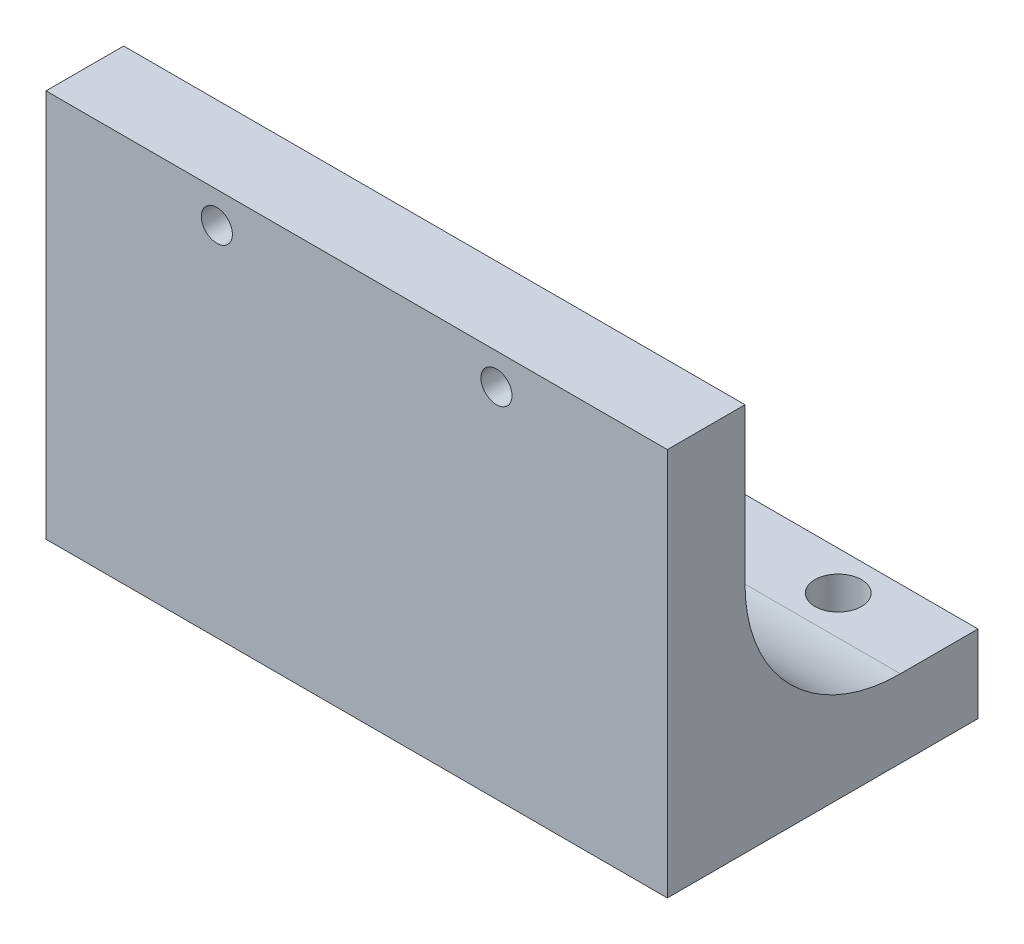
ISO-10303-21;
HEADER;
FILE_DESCRIPTION(('STEP AP214'),'2;1');
FILE_NAME('part.step','',(''),(''),'','','');
FILE_SCHEMA(('AUTOMOTIVE_DESIGN { 1 0 10303 214 1 1 1 1 }'));
ENDSEC;
DATA;
#1=APPLICATION_CONTEXT('core data for automotive mechanical design processes');
#2=APPLICATION_PROTOCOL_DEFINITION('international standard','automotive_design',2000,#1);
#3=PRODUCT_CONTEXT('',#1,'mechanical');
#4=PRODUCT('Part','Part','',(#3));
#5=PRODUCT_RELATED_PRODUCT_CATEGORY('part','',(#4));
#6=PRODUCT_DEFINITION_FORMATION('','',#4);
#7=PRODUCT_DEFINITION_CONTEXT('part definition',#1,'design');
#8=PRODUCT_DEFINITION('design','',#6,#7);
#9=PRODUCT_DEFINITION_SHAPE('','',#8);
#10=(LENGTH_UNIT() NAMED_UNIT(*) SI_UNIT(.MILLI.,.METRE.));
#11=(NAMED_UNIT(*) PLANE_ANGLE_UNIT() SI_UNIT($,.RADIAN.));
#12=(NAMED_UNIT(*) SI_UNIT($,.STERADIAN.) SOLID_ANGLE_UNIT());
#13=UNCERTAINTY_MEASURE_WITH_UNIT(LENGTH_MEASURE(1.E-05),#10,'distance_accuracy_value','');
#14=(GEOMETRIC_REPRESENTATION_CONTEXT(3) GLOBAL_UNCERTAINTY_ASSIGNED_CONTEXT((#13)) GLOBAL_UNIT_ASSIGNED_CONTEXT((#10,
#11,#12)) REPRESENTATION_CONTEXT('',''));
#15=CARTESIAN_POINT('',(0.,0.,0.));
#16=DIRECTION('',(0.,0.,1.));
#17=DIRECTION('',(1.,0.,0.));
#18=AXIS2_PLACEMENT_3D('',#15,#16,#17);
#19=CARTESIAN_POINT('',(0.,0.,0.));
#20=DIRECTION('',(0.,0.,-1.));
#21=DIRECTION('',(-1.,0.,0.));
#22=AXIS2_PLACEMENT_3D('',#19,#20,#21);
#23=PLANE('',#22);
#24=CARTESIAN_POINT('',(11.,23.,0.));
#25=DIRECTION('',(0.,0.,1.));
#26=DIRECTION('',(1.,0.,0.));
#27=AXIS2_PLACEMENT_3D('',#24,#25,#26);
#28=CIRCLE('',#27,1.);
#29=CARTESIAN_POINT('',(12.,23.,0.));
#30=VERTEX_POINT('',#29);
#31=EDGE_CURVE('E137',#30,#30,#28,.T.);
#32=ORIENTED_EDGE('',*,*,#31,.T.);
#33=EDGE_LOOP('',(#32));
#34=FACE_BOUND('',#33,.T.);
#35=CARTESIAN_POINT('',(29.,23.,0.));
#36=DIRECTION('',(0.,0.,1.));
#37=DIRECTION('',(1.,0.,0.));
#38=AXIS2_PLACEMENT_3D('',#35,#36,#37);
#39=CIRCLE('',#38,1.);
#40=CARTESIAN_POINT('',(30.,23.,0.));
#41=VERTEX_POINT('',#40);
#42=EDGE_CURVE('E131',#41,#41,#39,.T.);
#43=ORIENTED_EDGE('',*,*,#42,.T.);
#44=EDGE_LOOP('',(#43));
#45=FACE_BOUND('',#44,.T.);
#46=DIRECTION('',(0.,1.,0.));
#47=VECTOR('',#46,1.);
#48=CARTESIAN_POINT('',(40.,0.,0.));
#49=LINE('',#48,#47);
#50=CARTESIAN_POINT('',(40.,15.,0.));
#51=VERTEX_POINT('',#50);
#52=CARTESIAN_POINT('',(40.,25.,0.));
#53=VERTEX_POINT('',#52);
#54=EDGE_CURVE('E166',#51,#53,#49,.T.);
#55=ORIENTED_EDGE('',*,*,#54,.F.);
#56=DIRECTION('',(-1.,0.,0.));
#57=VECTOR('',#56,1.);
#58=CARTESIAN_POINT('',(0.,15.,0.));
#59=LINE('',#58,#57);
#60=CARTESIAN_POINT('',(0.,15.,0.));
#61=VERTEX_POINT('',#60);
#62=EDGE_CURVE('E183',#51,#61,#59,.T.);
#63=ORIENTED_EDGE('',*,*,#62,.T.);
#64=DIRECTION('',(0.,-1.,0.));
#65=VECTOR('',#64,1.);
#66=CARTESIAN_POINT('',(0.,0.,0.));
#67=LINE('',#66,#65);
#68=CARTESIAN_POINT('',(0.,25.,0.));
#69=VERTEX_POINT('',#68);
#70=EDGE_CURVE('E145',#69,#61,#67,.T.);
#71=ORIENTED_EDGE('',*,*,#70,.F.);
#72=DIRECTION('',(-1.,0.,0.));
#73=VECTOR('',#72,1.);
#74=CARTESIAN_POINT('',(0.,25.,0.));
#75=LINE('',#74,#73);
#76=EDGE_CURVE('E154',#53,#69,#75,.T.);
#77=ORIENTED_EDGE('',*,*,#76,.F.);
#78=EDGE_LOOP('',(#55,#63,#71,#77));
#79=FACE_BOUND('',#78,.T.);
#80=ADVANCED_FACE('F38',(#34,#45,#79),#23,.T.);
#81=CARTESIAN_POINT('',(0.,0.,5.));
#82=DIRECTION('',(0.,0.,-1.));
#83=DIRECTION('',(-1.,0.,0.));
#84=AXIS2_PLACEMENT_3D('',#81,#82,#83);
#85=PLANE('',#84);
#86=DIRECTION('',(0.,-1.,0.));
#87=VECTOR('',#86,1.);
#88=CARTESIAN_POINT('',(0.,0.,5.));
#89=LINE('',#88,#87);
#90=CARTESIAN_POINT('',(0.,25.,5.));
#91=VERTEX_POINT('',#90);
#92=CARTESIAN_POINT('',(0.,0.,5.));
#93=VERTEX_POINT('',#92);
#94=EDGE_CURVE('E149',#91,#93,#89,.T.);
#95=ORIENTED_EDGE('',*,*,#94,.T.);
#96=DIRECTION('',(1.,0.,0.));
#97=VECTOR('',#96,1.);
#98=CARTESIAN_POINT('',(0.,0.,5.));
#99=LINE('',#98,#97);
#100=CARTESIAN_POINT('',(40.,0.,5.));
#101=VERTEX_POINT('',#100);
#102=EDGE_CURVE('E153',#93,#101,#99,.T.);
#103=ORIENTED_EDGE('',*,*,#102,.T.);
#104=DIRECTION('',(0.,1.,0.));
#105=VECTOR('',#104,1.);
#106=CARTESIAN_POINT('',(40.,0.,5.));
#107=LINE('',#106,#105);
#108=CARTESIAN_POINT('',(40.,25.,5.));
#109=VERTEX_POINT('',#108);
#110=EDGE_CURVE('E157',#101,#109,#107,.T.);
#111=ORIENTED_EDGE('',*,*,#110,.T.);
#112=DIRECTION('',(-1.,0.,0.));
#113=VECTOR('',#112,1.);
#114=CARTESIAN_POINT('',(0.,25.,5.));
#115=LINE('',#114,#113);
#116=EDGE_CURVE('E160',#109,#91,#115,.T.);
#117=ORIENTED_EDGE('',*,*,#116,.T.);
#118=EDGE_LOOP('',(#95,#103,#111,#117));
#119=FACE_BOUND('',#118,.T.);
#120=CARTESIAN_POINT('',(11.,23.,5.));
#121=DIRECTION('',(0.,0.,1.));
#122=DIRECTION('',(1.,0.,0.));
#123=AXIS2_PLACEMENT_3D('',#120,#121,#122);
#124=CIRCLE('',#123,1.);
#125=CARTESIAN_POINT('',(12.,23.,5.));
#126=VERTEX_POINT('',#125);
#127=EDGE_CURVE('E141',#126,#126,#124,.T.);
#128=ORIENTED_EDGE('',*,*,#127,.F.);
#129=EDGE_LOOP('',(#128));
#130=FACE_BOUND('',#129,.T.);
#131=CARTESIAN_POINT('',(29.,23.,5.));
#132=DIRECTION('',(0.,0.,1.));
#133=DIRECTION('',(1.,0.,0.));
#134=AXIS2_PLACEMENT_3D('',#131,#132,#133);
#135=CIRCLE('',#134,1.);
#136=CARTESIAN_POINT('',(30.,23.,5.));
#137=VERTEX_POINT('',#136);
#138=EDGE_CURVE('E133',#137,#137,#135,.T.);
#139=ORIENTED_EDGE('',*,*,#138,.F.);
#140=EDGE_LOOP('',(#139));
#141=FACE_BOUND('',#140,.T.);
#142=ADVANCED_FACE('F230',(#119,#130,#141),#85,.F.);
#143=CARTESIAN_POINT('',(0.,0.,5.));
#144=DIRECTION('',(1.,0.,0.));
#145=DIRECTION('',(0.,1.,0.));
#146=AXIS2_PLACEMENT_3D('',#143,#144,#145);
#147=PLANE('',#146);
#148=ORIENTED_EDGE('',*,*,#70,.T.);
#149=CARTESIAN_POINT('',(0.,15.,-10.));
#150=DIRECTION('',(1.,0.,0.));
#151=DIRECTION('',(0.,1.,0.));
#152=AXIS2_PLACEMENT_3D('',#149,#150,#151);
#153=CIRCLE('',#152,10.);
#154=CARTESIAN_POINT('',(0.,5.,-10.));
#155=VERTEX_POINT('',#154);
#156=EDGE_CURVE('E48',#61,#155,#153,.T.);
#157=ORIENTED_EDGE('',*,*,#156,.T.);
#158=DIRECTION('',(0.,0.,-1.));
#159=VECTOR('',#158,1.);
#160=CARTESIAN_POINT('',(0.,5.,0.));
#161=LINE('',#160,#159);
#162=CARTESIAN_POINT('',(0.,5.,-15.));
#163=VERTEX_POINT('',#162);
#164=EDGE_CURVE('E125',#155,#163,#161,.T.);
#165=ORIENTED_EDGE('',*,*,#164,.T.);
#166=DIRECTION('',(0.,-1.,0.));
#167=VECTOR('',#166,1.);
#168=CARTESIAN_POINT('',(0.,0.,-15.));
#169=LINE('',#168,#167);
#170=CARTESIAN_POINT('',(0.,0.,-15.));
#171=VERTEX_POINT('',#170);
#172=EDGE_CURVE('E106',#163,#171,#169,.T.);
#173=ORIENTED_EDGE('',*,*,#172,.T.);
#174=DIRECTION('',(0.,0.,-1.));
#175=VECTOR('',#174,1.);
#176=CARTESIAN_POINT('',(0.,0.,5.));
#177=LINE('',#176,#175);
#178=EDGE_CURVE('E180',#93,#171,#177,.T.);
#179=ORIENTED_EDGE('',*,*,#178,.F.);
#180=ORIENTED_EDGE('',*,*,#94,.F.);
#181=DIRECTION('',(0.,0.,-1.));
#182=VECTOR('',#181,1.);
#183=CARTESIAN_POINT('',(0.,25.,5.));
#184=LINE('',#183,#182);
#185=EDGE_CURVE('E163',#91,#69,#184,.T.);
#186=ORIENTED_EDGE('',*,*,#185,.T.);
#187=EDGE_LOOP('',(#148,#157,#165,#173,#179,#180,#186));
#188=FACE_BOUND('',#187,.T.);
#189=ADVANCED_FACE('F213',(#188),#147,.F.);
#190=CARTESIAN_POINT('',(0.,0.,5.));
#191=DIRECTION('',(0.,1.,0.));
#192=DIRECTION('',(0.,0.,1.));
#193=AXIS2_PLACEMENT_3D('',#190,#191,#192);
#194=PLANE('',#193);
#195=CARTESIAN_POINT('',(6.5,0.,-12.5));
#196=DIRECTION('',(0.,-1.,0.));
#197=DIRECTION('',(0.,0.,-1.));
#198=AXIS2_PLACEMENT_3D('',#195,#196,#197);
#199=CIRCLE('',#198,1.5);
#200=CARTESIAN_POINT('',(6.5,0.,-14.));
#201=VERTEX_POINT('',#200);
#202=EDGE_CURVE('E193',#201,#201,#199,.T.);
#203=ORIENTED_EDGE('',*,*,#202,.F.);
#204=EDGE_LOOP('',(#203));
#205=FACE_BOUND('',#204,.T.);
#206=CARTESIAN_POINT('',(33.5,0.,-12.5));
#207=DIRECTION('',(0.,-1.,0.));
#208=DIRECTION('',(0.,0.,-1.));
#209=AXIS2_PLACEMENT_3D('',#206,#207,#208);
#210=CIRCLE('',#209,1.5);
#211=CARTESIAN_POINT('',(33.5,0.,-14.));
#212=VERTEX_POINT('',#211);
#213=EDGE_CURVE('E200',#212,#212,#210,.T.);
#214=ORIENTED_EDGE('',*,*,#213,.F.);
#215=EDGE_LOOP('',(#214));
#216=FACE_BOUND('',#215,.T.);
#217=ORIENTED_EDGE('',*,*,#178,.T.);
#218=DIRECTION('',(-1.,0.,0.));
#219=VECTOR('',#218,1.);
#220=CARTESIAN_POINT('',(40.,0.,-15.));
#221=LINE('',#220,#219);
#222=CARTESIAN_POINT('',(40.,0.,-15.));
#223=VERTEX_POINT('',#222);
#224=EDGE_CURVE('E114',#223,#171,#221,.T.);
#225=ORIENTED_EDGE('',*,*,#224,.F.);
#226=DIRECTION('',(0.,0.,-1.));
#227=VECTOR('',#226,1.);
#228=CARTESIAN_POINT('',(40.,0.,5.));
#229=LINE('',#228,#227);
#230=EDGE_CURVE('E119',#101,#223,#229,.T.);
#231=ORIENTED_EDGE('',*,*,#230,.F.);
#232=ORIENTED_EDGE('',*,*,#102,.F.);
#233=EDGE_LOOP('',(#217,#225,#231,#232));
#234=FACE_BOUND('',#233,.T.);
#235=ADVANCED_FACE('F210',(#205,#216,#234),#194,.F.);
#236=CARTESIAN_POINT('',(40.,0.,5.));
#237=DIRECTION('',(-1.,0.,0.));
#238=DIRECTION('',(0.,-1.,0.));
#239=AXIS2_PLACEMENT_3D('',#236,#237,#238);
#240=PLANE('',#239);
#241=ORIENTED_EDGE('',*,*,#230,.T.);
#242=DIRECTION('',(0.,-1.,0.));
#243=VECTOR('',#242,1.);
#244=CARTESIAN_POINT('',(40.,0.,-15.));
#245=LINE('',#244,#243);
#246=CARTESIAN_POINT('',(40.,5.00000000000002,-15.));
#247=VERTEX_POINT('',#246);
#248=EDGE_CURVE('E105',#247,#223,#245,.T.);
#249=ORIENTED_EDGE('',*,*,#248,.F.);
#250=DIRECTION('',(0.,0.,-1.));
#251=VECTOR('',#250,1.);
#252=CARTESIAN_POINT('',(40.,5.00000000000002,0.));
#253=LINE('',#252,#251);
#254=CARTESIAN_POINT('',(40.,5.00000000000002,-10.));
#255=VERTEX_POINT('',#254);
#256=EDGE_CURVE('E96',#255,#247,#253,.T.);
#257=ORIENTED_EDGE('',*,*,#256,.F.);
#258=CARTESIAN_POINT('',(40.,15.,-10.));
#259=DIRECTION('',(-1.,0.,0.));
#260=DIRECTION('',(0.,-1.,0.));
#261=AXIS2_PLACEMENT_3D('',#258,#259,#260);
#262=CIRCLE('',#261,10.);
#263=EDGE_CURVE('E11',#255,#51,#262,.T.);
#264=ORIENTED_EDGE('',*,*,#263,.T.);
#265=ORIENTED_EDGE('',*,*,#54,.T.);
#266=DIRECTION('',(0.,0.,-1.));
#267=VECTOR('',#266,1.);
#268=CARTESIAN_POINT('',(40.,25.,5.));
#269=LINE('',#268,#267);
#270=EDGE_CURVE('E174',#109,#53,#269,.T.);
#271=ORIENTED_EDGE('',*,*,#270,.F.);
#272=ORIENTED_EDGE('',*,*,#110,.F.);
#273=EDGE_LOOP('',(#241,#249,#257,#264,#265,#271,#272));
#274=FACE_BOUND('',#273,.T.);
#275=ADVANCED_FACE('F116',(#274),#240,.F.);
#276=CARTESIAN_POINT('',(0.,25.,5.));
#277=DIRECTION('',(0.,-1.,0.));
#278=DIRECTION('',(0.,0.,-1.));
#279=AXIS2_PLACEMENT_3D('',#276,#277,#278);
#280=PLANE('',#279);
#281=ORIENTED_EDGE('',*,*,#76,.T.);
#282=ORIENTED_EDGE('',*,*,#185,.F.);
#283=ORIENTED_EDGE('',*,*,#116,.F.);
#284=ORIENTED_EDGE('',*,*,#270,.T.);
#285=EDGE_LOOP('',(#281,#282,#283,#284));
#286=FACE_BOUND('',#285,.T.);
#287=ADVANCED_FACE('F227',(#286),#280,.F.);
#288=CARTESIAN_POINT('',(11.,23.,5.));
#289=DIRECTION('',(0.,0.,-1.));
#290=DIRECTION('',(-1.,0.,0.));
#291=AXIS2_PLACEMENT_3D('',#288,#289,#290);
#292=CYLINDRICAL_SURFACE('',#291,1.);
#293=ORIENTED_EDGE('',*,*,#127,.T.);
#294=EDGE_LOOP('',(#293));
#295=FACE_BOUND('',#294,.T.);
#296=ORIENTED_EDGE('',*,*,#31,.F.);
#297=EDGE_LOOP('',(#296));
#298=FACE_BOUND('',#297,.T.);
#299=ADVANCED_FACE('F241',(#295,#298),#292,.F.);
#300=CARTESIAN_POINT('',(29.,23.,5.));
#301=DIRECTION('',(0.,0.,-1.));
#302=DIRECTION('',(-1.,0.,0.));
#303=AXIS2_PLACEMENT_3D('',#300,#301,#302);
#304=CYLINDRICAL_SURFACE('',#303,1.);
#305=ORIENTED_EDGE('',*,*,#138,.T.);
#306=EDGE_LOOP('',(#305));
#307=FACE_BOUND('',#306,.T.);
#308=ORIENTED_EDGE('',*,*,#42,.F.);
#309=EDGE_LOOP('',(#308));
#310=FACE_BOUND('',#309,.T.);
#311=ADVANCED_FACE('F238',(#307,#310),#304,.F.);
#312=CARTESIAN_POINT('',(40.,0.,-15.));
#313=DIRECTION('',(0.,0.,-1.));
#314=DIRECTION('',(-1.,0.,0.));
#315=AXIS2_PLACEMENT_3D('',#312,#313,#314);
#316=PLANE('',#315);
#317=ORIENTED_EDGE('',*,*,#172,.F.);
#318=DIRECTION('',(-1.,0.,0.));
#319=VECTOR('',#318,1.);
#320=CARTESIAN_POINT('',(40.,5.00000000000002,-15.));
#321=LINE('',#320,#319);
#322=EDGE_CURVE('E99',#247,#163,#321,.T.);
#323=ORIENTED_EDGE('',*,*,#322,.F.);
#324=ORIENTED_EDGE('',*,*,#248,.T.);
#325=ORIENTED_EDGE('',*,*,#224,.T.);
#326=EDGE_LOOP('',(#317,#323,#324,#325));
#327=FACE_BOUND('',#326,.T.);
#328=ADVANCED_FACE('F110',(#327),#316,.T.);
#329=CARTESIAN_POINT('',(40.,5.00000000000002,0.));
#330=DIRECTION('',(0.,1.,0.));
#331=DIRECTION('',(-1.,0.,0.));
#332=AXIS2_PLACEMENT_3D('',#329,#330,#331);
#333=PLANE('',#332);
#334=CARTESIAN_POINT('',(6.5,5.,-12.5));
#335=DIRECTION('',(0.,1.,0.));
#336=DIRECTION('',(-1.,0.,0.));
#337=AXIS2_PLACEMENT_3D('',#334,#335,#336);
#338=CIRCLE('',#337,1.5);
#339=CARTESIAN_POINT('',(5.,5.,-12.5));
#340=VERTEX_POINT('',#339);
#341=EDGE_CURVE('E42',#340,#340,#338,.T.);
#342=ORIENTED_EDGE('',*,*,#341,.F.);
#343=EDGE_LOOP('',(#342));
#344=FACE_BOUND('',#343,.T.);
#345=CARTESIAN_POINT('',(33.5,5.00000000000002,-12.5));
#346=DIRECTION('',(0.,1.,0.));
#347=DIRECTION('',(-1.,0.,0.));
#348=AXIS2_PLACEMENT_3D('',#345,#346,#347);
#349=CIRCLE('',#348,1.5);
#350=CARTESIAN_POINT('',(32.,5.00000000000002,-12.5));
#351=VERTEX_POINT('',#350);
#352=EDGE_CURVE('E190',#351,#351,#349,.T.);
#353=ORIENTED_EDGE('',*,*,#352,.F.);
#354=EDGE_LOOP('',(#353));
#355=FACE_BOUND('',#354,.T.);
#356=ORIENTED_EDGE('',*,*,#164,.F.);
#357=DIRECTION('',(-1.,0.,0.));
#358=VECTOR('',#357,1.);
#359=CARTESIAN_POINT('',(40.,5.00000000000002,-10.));
#360=LINE('',#359,#358);
#361=EDGE_CURVE('E56',#155,#255,#360,.F.);
#362=ORIENTED_EDGE('',*,*,#361,.T.);
#363=ORIENTED_EDGE('',*,*,#256,.T.);
#364=ORIENTED_EDGE('',*,*,#322,.T.);
#365=EDGE_LOOP('',(#356,#362,#363,#364));
#366=FACE_BOUND('',#365,.T.);
#367=ADVANCED_FACE('F98',(#344,#355,#366),#333,.T.);
#368=CARTESIAN_POINT('',(0.,15.,-10.));
#369=DIRECTION('',(1.,0.,0.));
#370=DIRECTION('',(0.,1.,0.));
#371=AXIS2_PLACEMENT_3D('',#368,#369,#370);
#372=CYLINDRICAL_SURFACE('',#371,10.);
#373=ORIENTED_EDGE('',*,*,#263,.F.);
#374=ORIENTED_EDGE('',*,*,#361,.F.);
#375=ORIENTED_EDGE('',*,*,#156,.F.);
#376=ORIENTED_EDGE('',*,*,#62,.F.);
#377=EDGE_LOOP('',(#373,#374,#375,#376));
#378=FACE_BOUND('',#377,.T.);
#379=ADVANCED_FACE('F40',(#378),#372,.F.);
#380=CARTESIAN_POINT('',(33.5,40.,-12.5));
#381=DIRECTION('',(0.,-1.,0.));
#382=DIRECTION('',(0.,0.,-1.));
#383=AXIS2_PLACEMENT_3D('',#380,#381,#382);
#384=CYLINDRICAL_SURFACE('',#383,1.5);
#385=ORIENTED_EDGE('',*,*,#352,.T.);
#386=EDGE_LOOP('',(#385));
#387=FACE_BOUND('',#386,.T.);
#388=ORIENTED_EDGE('',*,*,#213,.T.);
#389=EDGE_LOOP('',(#388));
#390=FACE_BOUND('',#389,.T.);
#391=ADVANCED_FACE('F208',(#387,#390),#384,.F.);
#392=CARTESIAN_POINT('',(6.5,40.,-12.5));
#393=DIRECTION('',(0.,-1.,0.));
#394=DIRECTION('',(0.,0.,-1.));
#395=AXIS2_PLACEMENT_3D('',#392,#393,#394);
#396=CYLINDRICAL_SURFACE('',#395,1.5);
#397=ORIENTED_EDGE('',*,*,#341,.T.);
#398=EDGE_LOOP('',(#397));
#399=FACE_BOUND('',#398,.T.);
#400=ORIENTED_EDGE('',*,*,#202,.T.);
#401=EDGE_LOOP('',(#400));
#402=FACE_BOUND('',#401,.T.);
#403=ADVANCED_FACE('F289',(#399,#402),#396,.F.);
#404=CLOSED_SHELL('',(#80,#142,#189,#235,#275,#287,#299,#311,#328,#367,#379,#391,#403));
#405=MANIFOLD_SOLID_BREP('B2',#404);
#406=ADVANCED_BREP_SHAPE_REPRESENTATION('',(#18,#405),#14);
#407=SHAPE_DEFINITION_REPRESENTATION(#9,#406);
ENDSEC;
END-ISO-10303-21;
